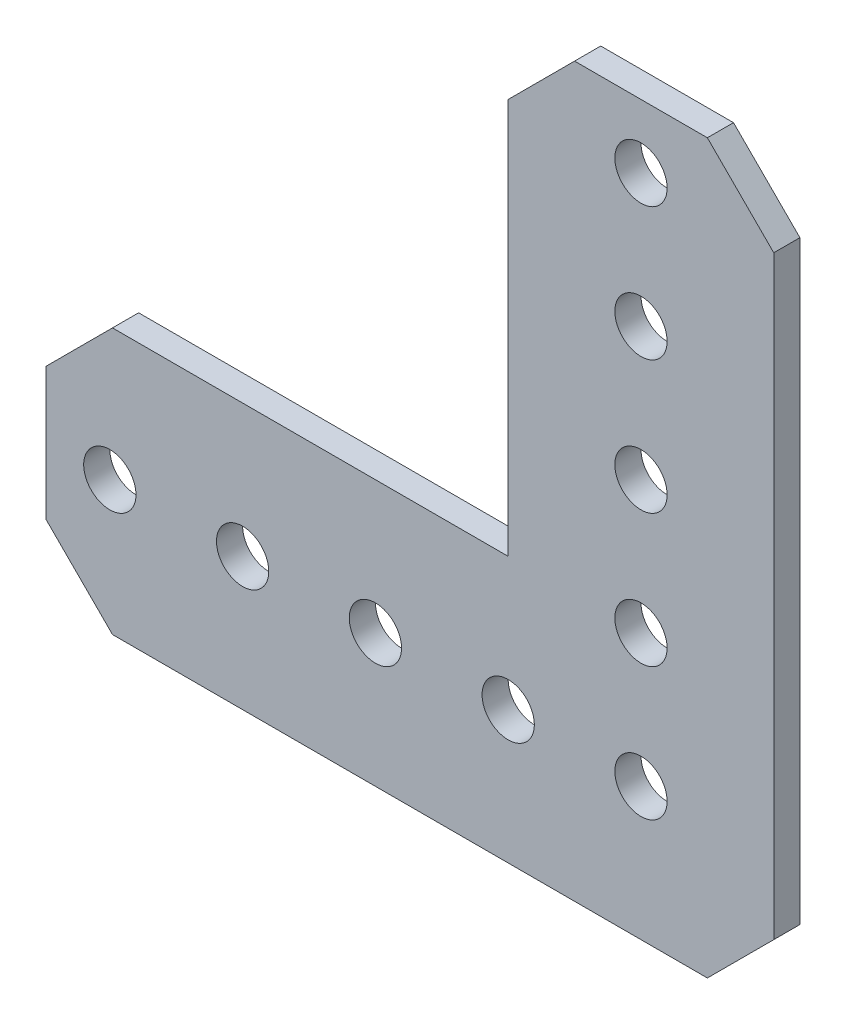
ISO-10303-21;
HEADER;
FILE_DESCRIPTION(('STEP AP214'),'2;1');
FILE_NAME('part.step','',(''),(''),'','','');
FILE_SCHEMA(('AUTOMOTIVE_DESIGN { 1 0 10303 214 1 1 1 1 }'));
ENDSEC;
DATA;
#1=APPLICATION_CONTEXT('core data for automotive mechanical design processes');
#2=APPLICATION_PROTOCOL_DEFINITION('international standard','automotive_design',2000,#1);
#3=PRODUCT_CONTEXT('',#1,'mechanical');
#4=PRODUCT('Part','Part','',(#3));
#5=PRODUCT_RELATED_PRODUCT_CATEGORY('part','',(#4));
#6=PRODUCT_DEFINITION_FORMATION('','',#4);
#7=PRODUCT_DEFINITION_CONTEXT('part definition',#1,'design');
#8=PRODUCT_DEFINITION('design','',#6,#7);
#9=PRODUCT_DEFINITION_SHAPE('','',#8);
#10=(LENGTH_UNIT() NAMED_UNIT(*) SI_UNIT(.MILLI.,.METRE.));
#11=(NAMED_UNIT(*) PLANE_ANGLE_UNIT() SI_UNIT($,.RADIAN.));
#12=(NAMED_UNIT(*) SI_UNIT($,.STERADIAN.) SOLID_ANGLE_UNIT());
#13=UNCERTAINTY_MEASURE_WITH_UNIT(LENGTH_MEASURE(1.E-05),#10,'distance_accuracy_value','');
#14=(GEOMETRIC_REPRESENTATION_CONTEXT(3) GLOBAL_UNCERTAINTY_ASSIGNED_CONTEXT((#13)) GLOBAL_UNIT_ASSIGNED_CONTEXT((#10,
#11,#12)) REPRESENTATION_CONTEXT('',''));
#15=CARTESIAN_POINT('',(0.,0.,0.));
#16=DIRECTION('',(0.,0.,1.));
#17=DIRECTION('',(1.,0.,0.));
#18=AXIS2_PLACEMENT_3D('',#15,#16,#17);
#19=CARTESIAN_POINT('',(12.7,-6.35,1.25));
#20=DIRECTION('',(0.707106781186548,-0.707106781186548,0.));
#21=DIRECTION('',(0.707106781186548,0.707106781186548,0.));
#22=AXIS2_PLACEMENT_3D('',#19,#20,#21);
#23=PLANE('',#22);
#24=DIRECTION('',(-0.707106781186547,-0.707106781186547,0.));
#25=VECTOR('',#24,1.);
#26=CARTESIAN_POINT('',(12.7,-6.35,-1.25));
#27=LINE('',#26,#25);
#28=CARTESIAN_POINT('',(12.7,-6.35,-1.25));
#29=VERTEX_POINT('',#28);
#30=CARTESIAN_POINT('',(6.35,-12.7,-1.25));
#31=VERTEX_POINT('',#30);
#32=EDGE_CURVE('E166',#29,#31,#27,.T.);
#33=ORIENTED_EDGE('',*,*,#32,.F.);
#34=DIRECTION('',(0.,0.,-1.));
#35=VECTOR('',#34,1.);
#36=CARTESIAN_POINT('',(12.7,-6.35,1.25));
#37=LINE('',#36,#35);
#38=CARTESIAN_POINT('',(12.7,-6.35,1.25));
#39=VERTEX_POINT('',#38);
#40=EDGE_CURVE('E11',#39,#29,#37,.T.);
#41=ORIENTED_EDGE('',*,*,#40,.F.);
#42=DIRECTION('',(-0.707106781186547,-0.707106781186547,0.));
#43=VECTOR('',#42,1.);
#44=CARTESIAN_POINT('',(12.7,-6.35,1.25));
#45=LINE('',#44,#43);
#46=CARTESIAN_POINT('',(6.35,-12.7,1.25));
#47=VERTEX_POINT('',#46);
#48=EDGE_CURVE('E207',#39,#47,#45,.T.);
#49=ORIENTED_EDGE('',*,*,#48,.T.);
#50=DIRECTION('',(0.,0.,-1.));
#51=VECTOR('',#50,1.);
#52=CARTESIAN_POINT('',(6.35,-12.7,1.25));
#53=LINE('',#52,#51);
#54=EDGE_CURVE('E48',#47,#31,#53,.T.);
#55=ORIENTED_EDGE('',*,*,#54,.T.);
#56=EDGE_LOOP('',(#33,#41,#49,#55));
#57=FACE_BOUND('',#56,.T.);
#58=ADVANCED_FACE('F45',(#57),#23,.T.);
#59=CARTESIAN_POINT('',(12.6999999999998,50.546,1.25));
#60=DIRECTION('',(1.,0.,0.));
#61=DIRECTION('',(0.,1.,0.));
#62=AXIS2_PLACEMENT_3D('',#59,#60,#61);
#63=PLANE('',#62);
#64=DIRECTION('',(0.,-1.,0.));
#65=VECTOR('',#64,1.);
#66=CARTESIAN_POINT('',(12.6999999999998,50.546,-1.25));
#67=LINE('',#66,#65);
#68=CARTESIAN_POINT('',(12.6999999999998,50.546,-1.25));
#69=VERTEX_POINT('',#68);
#70=EDGE_CURVE('E204',#69,#29,#67,.T.);
#71=ORIENTED_EDGE('',*,*,#70,.F.);
#72=DIRECTION('',(0.,0.,-1.));
#73=VECTOR('',#72,1.);
#74=CARTESIAN_POINT('',(12.6999999999998,50.546,1.25));
#75=LINE('',#74,#73);
#76=CARTESIAN_POINT('',(12.6999999999998,50.546,1.25));
#77=VERTEX_POINT('',#76);
#78=EDGE_CURVE('E55',#77,#69,#75,.T.);
#79=ORIENTED_EDGE('',*,*,#78,.F.);
#80=DIRECTION('',(0.,-1.,0.));
#81=VECTOR('',#80,1.);
#82=CARTESIAN_POINT('',(12.6999999999998,50.546,1.25));
#83=LINE('',#82,#81);
#84=EDGE_CURVE('E152',#77,#39,#83,.T.);
#85=ORIENTED_EDGE('',*,*,#84,.T.);
#86=ORIENTED_EDGE('',*,*,#40,.T.);
#87=EDGE_LOOP('',(#71,#79,#85,#86));
#88=FACE_BOUND('',#87,.T.);
#89=ADVANCED_FACE('F234',(#88),#63,.T.);
#90=CARTESIAN_POINT('',(6.34999999999981,56.896,1.25));
#91=DIRECTION('',(0.707106781186546,0.707106781186549,0.));
#92=DIRECTION('',(-0.707106781186549,0.707106781186546,0.));
#93=AXIS2_PLACEMENT_3D('',#90,#91,#92);
#94=PLANE('',#93);
#95=DIRECTION('',(0.707106781186549,-0.707106781186546,0.));
#96=VECTOR('',#95,1.);
#97=CARTESIAN_POINT('',(6.34999999999981,56.896,-1.25));
#98=LINE('',#97,#96);
#99=CARTESIAN_POINT('',(6.34999999999981,56.896,-1.25));
#100=VERTEX_POINT('',#99);
#101=EDGE_CURVE('E138',#100,#69,#98,.T.);
#102=ORIENTED_EDGE('',*,*,#101,.F.);
#103=DIRECTION('',(0.,0.,-1.));
#104=VECTOR('',#103,1.);
#105=CARTESIAN_POINT('',(6.34999999999981,56.896,1.25));
#106=LINE('',#105,#104);
#107=CARTESIAN_POINT('',(6.34999999999981,56.896,1.25));
#108=VERTEX_POINT('',#107);
#109=EDGE_CURVE('E133',#108,#100,#106,.T.);
#110=ORIENTED_EDGE('',*,*,#109,.F.);
#111=DIRECTION('',(0.707106781186549,-0.707106781186546,0.));
#112=VECTOR('',#111,1.);
#113=CARTESIAN_POINT('',(6.34999999999981,56.896,1.25));
#114=LINE('',#113,#112);
#115=EDGE_CURVE('E136',#108,#77,#114,.T.);
#116=ORIENTED_EDGE('',*,*,#115,.T.);
#117=ORIENTED_EDGE('',*,*,#78,.T.);
#118=EDGE_LOOP('',(#102,#110,#116,#117));
#119=FACE_BOUND('',#118,.T.);
#120=ADVANCED_FACE('F135',(#119),#94,.T.);
#121=CARTESIAN_POINT('',(-6.35000000000021,56.896,1.25));
#122=DIRECTION('',(0.,1.,0.));
#123=DIRECTION('',(0.,0.,1.));
#124=AXIS2_PLACEMENT_3D('',#121,#122,#123);
#125=PLANE('',#124);
#126=DIRECTION('',(1.,0.,0.));
#127=VECTOR('',#126,1.);
#128=CARTESIAN_POINT('',(-6.35000000000021,56.896,-1.25));
#129=LINE('',#128,#127);
#130=CARTESIAN_POINT('',(-6.35000000000021,56.896,-1.25));
#131=VERTEX_POINT('',#130);
#132=EDGE_CURVE('E199',#131,#100,#129,.T.);
#133=ORIENTED_EDGE('',*,*,#132,.F.);
#134=DIRECTION('',(0.,0.,-1.));
#135=VECTOR('',#134,1.);
#136=CARTESIAN_POINT('',(-6.35000000000021,56.896,1.25));
#137=LINE('',#136,#135);
#138=CARTESIAN_POINT('',(-6.35000000000021,56.896,1.25));
#139=VERTEX_POINT('',#138);
#140=EDGE_CURVE('E144',#139,#131,#137,.T.);
#141=ORIENTED_EDGE('',*,*,#140,.F.);
#142=DIRECTION('',(1.,0.,0.));
#143=VECTOR('',#142,1.);
#144=CARTESIAN_POINT('',(-6.35000000000021,56.896,1.25));
#145=LINE('',#144,#143);
#146=EDGE_CURVE('E150',#139,#108,#145,.T.);
#147=ORIENTED_EDGE('',*,*,#146,.T.);
#148=ORIENTED_EDGE('',*,*,#109,.T.);
#149=EDGE_LOOP('',(#133,#141,#147,#148));
#150=FACE_BOUND('',#149,.T.);
#151=ADVANCED_FACE('F155',(#150),#125,.T.);
#152=CARTESIAN_POINT('',(-12.7000000000002,50.546,1.25));
#153=DIRECTION('',(-0.707106781186548,0.707106781186547,0.));
#154=DIRECTION('',(-0.707106781186547,-0.707106781186548,0.));
#155=AXIS2_PLACEMENT_3D('',#152,#153,#154);
#156=PLANE('',#155);
#157=DIRECTION('',(0.707106781186547,0.707106781186548,0.));
#158=VECTOR('',#157,1.);
#159=CARTESIAN_POINT('',(-12.7000000000002,50.546,-1.25));
#160=LINE('',#159,#158);
#161=CARTESIAN_POINT('',(-12.7000000000002,50.546,-1.25));
#162=VERTEX_POINT('',#161);
#163=EDGE_CURVE('E195',#162,#131,#160,.T.);
#164=ORIENTED_EDGE('',*,*,#163,.F.);
#165=DIRECTION('',(0.,0.,-1.));
#166=VECTOR('',#165,1.);
#167=CARTESIAN_POINT('',(-12.7000000000002,50.546,1.25));
#168=LINE('',#167,#166);
#169=CARTESIAN_POINT('',(-12.7000000000002,50.546,1.25));
#170=VERTEX_POINT('',#169);
#171=EDGE_CURVE('E213',#170,#162,#168,.T.);
#172=ORIENTED_EDGE('',*,*,#171,.F.);
#173=DIRECTION('',(0.707106781186547,0.707106781186548,0.));
#174=VECTOR('',#173,1.);
#175=CARTESIAN_POINT('',(-12.7000000000002,50.546,1.25));
#176=LINE('',#175,#174);
#177=EDGE_CURVE('E157',#170,#139,#176,.T.);
#178=ORIENTED_EDGE('',*,*,#177,.T.);
#179=ORIENTED_EDGE('',*,*,#140,.T.);
#180=EDGE_LOOP('',(#164,#172,#178,#179));
#181=FACE_BOUND('',#180,.T.);
#182=ADVANCED_FACE('F247',(#181),#156,.T.);
#183=CARTESIAN_POINT('',(-12.7,12.7,1.25));
#184=DIRECTION('',(-1.,0.,0.));
#185=DIRECTION('',(0.,-1.,0.));
#186=AXIS2_PLACEMENT_3D('',#183,#184,#185);
#187=PLANE('',#186);
#188=DIRECTION('',(0.,1.,0.));
#189=VECTOR('',#188,1.);
#190=CARTESIAN_POINT('',(-12.7,12.7,-1.25));
#191=LINE('',#190,#189);
#192=CARTESIAN_POINT('',(-12.7,12.7,-1.25));
#193=VERTEX_POINT('',#192);
#194=EDGE_CURVE('E191',#193,#162,#191,.T.);
#195=ORIENTED_EDGE('',*,*,#194,.F.);
#196=DIRECTION('',(0.,0.,-1.));
#197=VECTOR('',#196,1.);
#198=CARTESIAN_POINT('',(-12.7,12.7,1.25));
#199=LINE('',#198,#197);
#200=CARTESIAN_POINT('',(-12.7,12.7,1.25));
#201=VERTEX_POINT('',#200);
#202=EDGE_CURVE('E216',#201,#193,#199,.T.);
#203=ORIENTED_EDGE('',*,*,#202,.F.);
#204=DIRECTION('',(0.,1.,0.));
#205=VECTOR('',#204,1.);
#206=CARTESIAN_POINT('',(-12.7,12.7,1.25));
#207=LINE('',#206,#205);
#208=EDGE_CURVE('E160',#201,#170,#207,.T.);
#209=ORIENTED_EDGE('',*,*,#208,.T.);
#210=ORIENTED_EDGE('',*,*,#171,.T.);
#211=EDGE_LOOP('',(#195,#203,#209,#210));
#212=FACE_BOUND('',#211,.T.);
#213=ADVANCED_FACE('F250',(#212),#187,.T.);
#214=CARTESIAN_POINT('',(-50.546,12.7,1.25));
#215=DIRECTION('',(0.,1.,0.));
#216=DIRECTION('',(0.,0.,1.));
#217=AXIS2_PLACEMENT_3D('',#214,#215,#216);
#218=PLANE('',#217);
#219=DIRECTION('',(1.,0.,0.));
#220=VECTOR('',#219,1.);
#221=CARTESIAN_POINT('',(-50.546,12.7,-1.25));
#222=LINE('',#221,#220);
#223=CARTESIAN_POINT('',(-50.546,12.7,-1.25));
#224=VERTEX_POINT('',#223);
#225=EDGE_CURVE('E187',#224,#193,#222,.T.);
#226=ORIENTED_EDGE('',*,*,#225,.F.);
#227=DIRECTION('',(0.,0.,-1.));
#228=VECTOR('',#227,1.);
#229=CARTESIAN_POINT('',(-50.546,12.7,1.25));
#230=LINE('',#229,#228);
#231=CARTESIAN_POINT('',(-50.546,12.7,1.25));
#232=VERTEX_POINT('',#231);
#233=EDGE_CURVE('E219',#232,#224,#230,.T.);
#234=ORIENTED_EDGE('',*,*,#233,.F.);
#235=DIRECTION('',(1.,0.,0.));
#236=VECTOR('',#235,1.);
#237=CARTESIAN_POINT('',(-50.546,12.7,1.25));
#238=LINE('',#237,#236);
#239=EDGE_CURVE('E410',#232,#201,#238,.T.);
#240=ORIENTED_EDGE('',*,*,#239,.T.);
#241=ORIENTED_EDGE('',*,*,#202,.T.);
#242=EDGE_LOOP('',(#226,#234,#240,#241));
#243=FACE_BOUND('',#242,.T.);
#244=ADVANCED_FACE('F254',(#243),#218,.T.);
#245=CARTESIAN_POINT('',(-56.896,6.35,1.25));
#246=DIRECTION('',(-0.707106781186547,0.707106781186548,0.));
#247=DIRECTION('',(-0.707106781186548,-0.707106781186547,0.));
#248=AXIS2_PLACEMENT_3D('',#245,#246,#247);
#249=PLANE('',#248);
#250=DIRECTION('',(0.707106781186548,0.707106781186547,0.));
#251=VECTOR('',#250,1.);
#252=CARTESIAN_POINT('',(-56.896,6.35,-1.25));
#253=LINE('',#252,#251);
#254=CARTESIAN_POINT('',(-56.896,6.35,-1.25));
#255=VERTEX_POINT('',#254);
#256=EDGE_CURVE('E183',#255,#224,#253,.T.);
#257=ORIENTED_EDGE('',*,*,#256,.F.);
#258=DIRECTION('',(0.,0.,-1.));
#259=VECTOR('',#258,1.);
#260=CARTESIAN_POINT('',(-56.896,6.35,1.25));
#261=LINE('',#260,#259);
#262=CARTESIAN_POINT('',(-56.896,6.35,1.25));
#263=VERTEX_POINT('',#262);
#264=EDGE_CURVE('E222',#263,#255,#261,.T.);
#265=ORIENTED_EDGE('',*,*,#264,.F.);
#266=DIRECTION('',(0.707106781186548,0.707106781186547,0.));
#267=VECTOR('',#266,1.);
#268=CARTESIAN_POINT('',(-56.896,6.35,1.25));
#269=LINE('',#268,#267);
#270=EDGE_CURVE('E406',#263,#232,#269,.T.);
#271=ORIENTED_EDGE('',*,*,#270,.T.);
#272=ORIENTED_EDGE('',*,*,#233,.T.);
#273=EDGE_LOOP('',(#257,#265,#271,#272));
#274=FACE_BOUND('',#273,.T.);
#275=ADVANCED_FACE('F258',(#274),#249,.T.);
#276=CARTESIAN_POINT('',(-56.896,-6.35,1.25));
#277=DIRECTION('',(-1.,0.,0.));
#278=DIRECTION('',(0.,0.,1.));
#279=AXIS2_PLACEMENT_3D('',#276,#277,#278);
#280=PLANE('',#279);
#281=DIRECTION('',(0.,1.,0.));
#282=VECTOR('',#281,1.);
#283=CARTESIAN_POINT('',(-56.896,-6.35,-1.25));
#284=LINE('',#283,#282);
#285=CARTESIAN_POINT('',(-56.896,-6.35,-1.25));
#286=VERTEX_POINT('',#285);
#287=EDGE_CURVE('E179',#286,#255,#284,.T.);
#288=ORIENTED_EDGE('',*,*,#287,.F.);
#289=DIRECTION('',(0.,0.,-1.));
#290=VECTOR('',#289,1.);
#291=CARTESIAN_POINT('',(-56.896,-6.35,1.25));
#292=LINE('',#291,#290);
#293=CARTESIAN_POINT('',(-56.896,-6.35,1.25));
#294=VERTEX_POINT('',#293);
#295=EDGE_CURVE('E225',#294,#286,#292,.T.);
#296=ORIENTED_EDGE('',*,*,#295,.F.);
#297=DIRECTION('',(0.,1.,0.));
#298=VECTOR('',#297,1.);
#299=CARTESIAN_POINT('',(-56.896,-6.35,1.25));
#300=LINE('',#299,#298);
#301=EDGE_CURVE('E402',#294,#263,#300,.T.);
#302=ORIENTED_EDGE('',*,*,#301,.T.);
#303=ORIENTED_EDGE('',*,*,#264,.T.);
#304=EDGE_LOOP('',(#288,#296,#302,#303));
#305=FACE_BOUND('',#304,.T.);
#306=ADVANCED_FACE('F262',(#305),#280,.T.);
#307=CARTESIAN_POINT('',(-50.546,-12.7,1.25));
#308=DIRECTION('',(-0.707106781186547,-0.707106781186548,0.));
#309=DIRECTION('',(0.707106781186548,-0.707106781186547,0.));
#310=AXIS2_PLACEMENT_3D('',#307,#308,#309);
#311=PLANE('',#310);
#312=DIRECTION('',(-0.707106781186548,0.707106781186547,0.));
#313=VECTOR('',#312,1.);
#314=CARTESIAN_POINT('',(-50.546,-12.7,-1.25));
#315=LINE('',#314,#313);
#316=CARTESIAN_POINT('',(-50.546,-12.7,-1.25));
#317=VERTEX_POINT('',#316);
#318=EDGE_CURVE('E175',#317,#286,#315,.T.);
#319=ORIENTED_EDGE('',*,*,#318,.F.);
#320=DIRECTION('',(0.,0.,-1.));
#321=VECTOR('',#320,1.);
#322=CARTESIAN_POINT('',(-50.546,-12.7,1.25));
#323=LINE('',#322,#321);
#324=CARTESIAN_POINT('',(-50.546,-12.7,1.25));
#325=VERTEX_POINT('',#324);
#326=EDGE_CURVE('E227',#325,#317,#323,.T.);
#327=ORIENTED_EDGE('',*,*,#326,.F.);
#328=DIRECTION('',(-0.707106781186548,0.707106781186547,0.));
#329=VECTOR('',#328,1.);
#330=CARTESIAN_POINT('',(-50.546,-12.7,1.25));
#331=LINE('',#330,#329);
#332=EDGE_CURVE('E398',#325,#294,#331,.T.);
#333=ORIENTED_EDGE('',*,*,#332,.T.);
#334=ORIENTED_EDGE('',*,*,#295,.T.);
#335=EDGE_LOOP('',(#319,#327,#333,#334));
#336=FACE_BOUND('',#335,.T.);
#337=ADVANCED_FACE('F266',(#336),#311,.T.);
#338=CARTESIAN_POINT('',(6.35,-12.7,1.25));
#339=DIRECTION('',(0.,-1.,0.));
#340=DIRECTION('',(0.,0.,-1.));
#341=AXIS2_PLACEMENT_3D('',#338,#339,#340);
#342=PLANE('',#341);
#343=DIRECTION('',(-1.,0.,0.));
#344=VECTOR('',#343,1.);
#345=CARTESIAN_POINT('',(6.35,-12.7,-1.25));
#346=LINE('',#345,#344);
#347=EDGE_CURVE('E170',#31,#317,#346,.T.);
#348=ORIENTED_EDGE('',*,*,#347,.F.);
#349=ORIENTED_EDGE('',*,*,#54,.F.);
#350=DIRECTION('',(-1.,0.,0.));
#351=VECTOR('',#350,1.);
#352=CARTESIAN_POINT('',(6.35,-12.7,1.25));
#353=LINE('',#352,#351);
#354=EDGE_CURVE('E395',#47,#325,#353,.T.);
#355=ORIENTED_EDGE('',*,*,#354,.T.);
#356=ORIENTED_EDGE('',*,*,#326,.T.);
#357=EDGE_LOOP('',(#348,#349,#355,#356));
#358=FACE_BOUND('',#357,.T.);
#359=ADVANCED_FACE('F231',(#358),#342,.T.);
#360=CARTESIAN_POINT('',(0.,0.,1.25));
#361=DIRECTION('',(0.,0.,-1.));
#362=DIRECTION('',(-1.,0.,0.));
#363=AXIS2_PLACEMENT_3D('',#360,#361,#362);
#364=PLANE('',#363);
#365=CARTESIAN_POINT('',(0.,38.1,1.25));
#366=DIRECTION('',(0.,0.,-1.));
#367=DIRECTION('',(1.,0.,0.));
#368=AXIS2_PLACEMENT_3D('',#365,#366,#367);
#369=CIRCLE('',#368,2.5);
#370=CARTESIAN_POINT('',(2.50000000000004,38.1,1.25));
#371=VERTEX_POINT('',#370);
#372=EDGE_CURVE('E321',#371,#371,#369,.T.);
#373=ORIENTED_EDGE('',*,*,#372,.T.);
#374=EDGE_LOOP('',(#373));
#375=FACE_BOUND('',#374,.T.);
#376=CARTESIAN_POINT('',(0.,50.8,1.25));
#377=DIRECTION('',(0.,0.,-1.));
#378=DIRECTION('',(1.,0.,0.));
#379=AXIS2_PLACEMENT_3D('',#376,#377,#378);
#380=CIRCLE('',#379,2.5);
#381=CARTESIAN_POINT('',(2.5,50.8,1.25));
#382=VERTEX_POINT('',#381);
#383=EDGE_CURVE('E331',#382,#382,#380,.T.);
#384=ORIENTED_EDGE('',*,*,#383,.T.);
#385=EDGE_LOOP('',(#384));
#386=FACE_BOUND('',#385,.T.);
#387=CARTESIAN_POINT('',(-38.1,0.,1.25));
#388=DIRECTION('',(0.,0.,-1.));
#389=DIRECTION('',(1.,0.,0.));
#390=AXIS2_PLACEMENT_3D('',#387,#388,#389);
#391=CIRCLE('',#390,2.5);
#392=CARTESIAN_POINT('',(-35.6,0.,1.25));
#393=VERTEX_POINT('',#392);
#394=EDGE_CURVE('E339',#393,#393,#391,.T.);
#395=ORIENTED_EDGE('',*,*,#394,.T.);
#396=EDGE_LOOP('',(#395));
#397=FACE_BOUND('',#396,.T.);
#398=CARTESIAN_POINT('',(-50.8,0.,1.25));
#399=DIRECTION('',(0.,0.,-1.));
#400=DIRECTION('',(1.,0.,0.));
#401=AXIS2_PLACEMENT_3D('',#398,#399,#400);
#402=CIRCLE('',#401,2.5);
#403=CARTESIAN_POINT('',(-48.3,0.,1.25));
#404=VERTEX_POINT('',#403);
#405=EDGE_CURVE('E347',#404,#404,#402,.T.);
#406=ORIENTED_EDGE('',*,*,#405,.T.);
#407=EDGE_LOOP('',(#406));
#408=FACE_BOUND('',#407,.T.);
#409=CARTESIAN_POINT('',(0.,0.,1.25));
#410=DIRECTION('',(0.,0.,-1.));
#411=DIRECTION('',(1.,0.,0.));
#412=AXIS2_PLACEMENT_3D('',#409,#410,#411);
#413=CIRCLE('',#412,2.5);
#414=CARTESIAN_POINT('',(2.5,0.,1.25));
#415=VERTEX_POINT('',#414);
#416=EDGE_CURVE('E355',#415,#415,#413,.T.);
#417=ORIENTED_EDGE('',*,*,#416,.T.);
#418=EDGE_LOOP('',(#417));
#419=FACE_BOUND('',#418,.T.);
#420=CARTESIAN_POINT('',(-25.4,0.,1.25));
#421=DIRECTION('',(0.,0.,-1.));
#422=DIRECTION('',(1.,0.,0.));
#423=AXIS2_PLACEMENT_3D('',#420,#421,#422);
#424=CIRCLE('',#423,2.5);
#425=CARTESIAN_POINT('',(-22.9,0.,1.25));
#426=VERTEX_POINT('',#425);
#427=EDGE_CURVE('E363',#426,#426,#424,.T.);
#428=ORIENTED_EDGE('',*,*,#427,.T.);
#429=EDGE_LOOP('',(#428));
#430=FACE_BOUND('',#429,.T.);
#431=CARTESIAN_POINT('',(-12.7,0.,1.25));
#432=DIRECTION('',(0.,0.,-1.));
#433=DIRECTION('',(1.,0.,0.));
#434=AXIS2_PLACEMENT_3D('',#431,#432,#433);
#435=CIRCLE('',#434,2.5);
#436=CARTESIAN_POINT('',(-10.2,0.,1.25));
#437=VERTEX_POINT('',#436);
#438=EDGE_CURVE('E371',#437,#437,#435,.T.);
#439=ORIENTED_EDGE('',*,*,#438,.T.);
#440=EDGE_LOOP('',(#439));
#441=FACE_BOUND('',#440,.T.);
#442=CARTESIAN_POINT('',(0.,25.4,1.25));
#443=DIRECTION('',(0.,0.,-1.));
#444=DIRECTION('',(1.,0.,0.));
#445=AXIS2_PLACEMENT_3D('',#442,#443,#444);
#446=CIRCLE('',#445,2.5);
#447=CARTESIAN_POINT('',(2.50000000000008,25.4,1.25));
#448=VERTEX_POINT('',#447);
#449=EDGE_CURVE('E379',#448,#448,#446,.T.);
#450=ORIENTED_EDGE('',*,*,#449,.T.);
#451=EDGE_LOOP('',(#450));
#452=FACE_BOUND('',#451,.T.);
#453=CARTESIAN_POINT('',(1.19131612205636E-13,12.7,1.25));
#454=DIRECTION('',(0.,0.,-1.));
#455=DIRECTION('',(1.,0.,0.));
#456=AXIS2_PLACEMENT_3D('',#453,#454,#455);
#457=CIRCLE('',#456,2.5);
#458=CARTESIAN_POINT('',(2.50000000000012,12.7,1.25));
#459=VERTEX_POINT('',#458);
#460=EDGE_CURVE('E171',#459,#459,#457,.T.);
#461=ORIENTED_EDGE('',*,*,#460,.T.);
#462=EDGE_LOOP('',(#461));
#463=FACE_BOUND('',#462,.T.);
#464=ORIENTED_EDGE('',*,*,#48,.F.);
#465=ORIENTED_EDGE('',*,*,#84,.F.);
#466=ORIENTED_EDGE('',*,*,#115,.F.);
#467=ORIENTED_EDGE('',*,*,#146,.F.);
#468=ORIENTED_EDGE('',*,*,#177,.F.);
#469=ORIENTED_EDGE('',*,*,#208,.F.);
#470=ORIENTED_EDGE('',*,*,#239,.F.);
#471=ORIENTED_EDGE('',*,*,#270,.F.);
#472=ORIENTED_EDGE('',*,*,#301,.F.);
#473=ORIENTED_EDGE('',*,*,#332,.F.);
#474=ORIENTED_EDGE('',*,*,#354,.F.);
#475=EDGE_LOOP('',(#464,#465,#466,#467,#468,#469,#470,#471,#472,#473,#474));
#476=FACE_BOUND('',#475,.T.);
#477=ADVANCED_FACE('F148',(#375,#386,#397,#408,#419,#430,#441,#452,#463,#476),#364,.F.);
#478=CARTESIAN_POINT('',(0.,0.,-1.25));
#479=DIRECTION('',(0.,0.,-1.));
#480=DIRECTION('',(-1.,0.,0.));
#481=AXIS2_PLACEMENT_3D('',#478,#479,#480);
#482=PLANE('',#481);
#483=CARTESIAN_POINT('',(0.,38.1,-1.25));
#484=DIRECTION('',(0.,0.,-1.));
#485=DIRECTION('',(1.,0.,0.));
#486=AXIS2_PLACEMENT_3D('',#483,#484,#485);
#487=CIRCLE('',#486,2.5);
#488=CARTESIAN_POINT('',(2.50000000000004,38.1,-1.25));
#489=VERTEX_POINT('',#488);
#490=EDGE_CURVE('E324',#489,#489,#487,.T.);
#491=ORIENTED_EDGE('',*,*,#490,.F.);
#492=EDGE_LOOP('',(#491));
#493=FACE_BOUND('',#492,.T.);
#494=CARTESIAN_POINT('',(0.,50.8,-1.25));
#495=DIRECTION('',(0.,0.,-1.));
#496=DIRECTION('',(1.,0.,0.));
#497=AXIS2_PLACEMENT_3D('',#494,#495,#496);
#498=CIRCLE('',#497,2.5);
#499=CARTESIAN_POINT('',(2.5,50.8,-1.25));
#500=VERTEX_POINT('',#499);
#501=EDGE_CURVE('E328',#500,#500,#498,.T.);
#502=ORIENTED_EDGE('',*,*,#501,.F.);
#503=EDGE_LOOP('',(#502));
#504=FACE_BOUND('',#503,.T.);
#505=CARTESIAN_POINT('',(-38.1,0.,-1.25));
#506=DIRECTION('',(0.,0.,-1.));
#507=DIRECTION('',(1.,0.,0.));
#508=AXIS2_PLACEMENT_3D('',#505,#506,#507);
#509=CIRCLE('',#508,2.5);
#510=CARTESIAN_POINT('',(-35.6,0.,-1.25));
#511=VERTEX_POINT('',#510);
#512=EDGE_CURVE('E335',#511,#511,#509,.T.);
#513=ORIENTED_EDGE('',*,*,#512,.F.);
#514=EDGE_LOOP('',(#513));
#515=FACE_BOUND('',#514,.T.);
#516=CARTESIAN_POINT('',(-50.8,0.,-1.25));
#517=DIRECTION('',(0.,0.,-1.));
#518=DIRECTION('',(1.,0.,0.));
#519=AXIS2_PLACEMENT_3D('',#516,#517,#518);
#520=CIRCLE('',#519,2.5);
#521=CARTESIAN_POINT('',(-48.3,0.,-1.25));
#522=VERTEX_POINT('',#521);
#523=EDGE_CURVE('E343',#522,#522,#520,.T.);
#524=ORIENTED_EDGE('',*,*,#523,.F.);
#525=EDGE_LOOP('',(#524));
#526=FACE_BOUND('',#525,.T.);
#527=CARTESIAN_POINT('',(0.,0.,-1.25));
#528=DIRECTION('',(0.,0.,-1.));
#529=DIRECTION('',(1.,0.,0.));
#530=AXIS2_PLACEMENT_3D('',#527,#528,#529);
#531=CIRCLE('',#530,2.5);
#532=CARTESIAN_POINT('',(2.5,0.,-1.25));
#533=VERTEX_POINT('',#532);
#534=EDGE_CURVE('E351',#533,#533,#531,.T.);
#535=ORIENTED_EDGE('',*,*,#534,.F.);
#536=EDGE_LOOP('',(#535));
#537=FACE_BOUND('',#536,.T.);
#538=CARTESIAN_POINT('',(-25.4,0.,-1.25));
#539=DIRECTION('',(0.,0.,-1.));
#540=DIRECTION('',(1.,0.,0.));
#541=AXIS2_PLACEMENT_3D('',#538,#539,#540);
#542=CIRCLE('',#541,2.5);
#543=CARTESIAN_POINT('',(-22.9,0.,-1.25));
#544=VERTEX_POINT('',#543);
#545=EDGE_CURVE('E359',#544,#544,#542,.T.);
#546=ORIENTED_EDGE('',*,*,#545,.F.);
#547=EDGE_LOOP('',(#546));
#548=FACE_BOUND('',#547,.T.);
#549=CARTESIAN_POINT('',(-12.7,0.,-1.25));
#550=DIRECTION('',(0.,0.,-1.));
#551=DIRECTION('',(1.,0.,0.));
#552=AXIS2_PLACEMENT_3D('',#549,#550,#551);
#553=CIRCLE('',#552,2.5);
#554=CARTESIAN_POINT('',(-10.2,0.,-1.25));
#555=VERTEX_POINT('',#554);
#556=EDGE_CURVE('E367',#555,#555,#553,.T.);
#557=ORIENTED_EDGE('',*,*,#556,.F.);
#558=EDGE_LOOP('',(#557));
#559=FACE_BOUND('',#558,.T.);
#560=CARTESIAN_POINT('',(0.,25.4,-1.25));
#561=DIRECTION('',(0.,0.,-1.));
#562=DIRECTION('',(1.,0.,0.));
#563=AXIS2_PLACEMENT_3D('',#560,#561,#562);
#564=CIRCLE('',#563,2.5);
#565=CARTESIAN_POINT('',(2.50000000000008,25.4,-1.25));
#566=VERTEX_POINT('',#565);
#567=EDGE_CURVE('E375',#566,#566,#564,.T.);
#568=ORIENTED_EDGE('',*,*,#567,.F.);
#569=EDGE_LOOP('',(#568));
#570=FACE_BOUND('',#569,.T.);
#571=CARTESIAN_POINT('',(1.19131612205636E-13,12.7,-1.25));
#572=DIRECTION('',(0.,0.,-1.));
#573=DIRECTION('',(1.,0.,0.));
#574=AXIS2_PLACEMENT_3D('',#571,#572,#573);
#575=CIRCLE('',#574,2.5);
#576=CARTESIAN_POINT('',(2.50000000000012,12.7,-1.25));
#577=VERTEX_POINT('',#576);
#578=EDGE_CURVE('E383',#577,#577,#575,.T.);
#579=ORIENTED_EDGE('',*,*,#578,.F.);
#580=EDGE_LOOP('',(#579));
#581=FACE_BOUND('',#580,.T.);
#582=ORIENTED_EDGE('',*,*,#32,.T.);
#583=ORIENTED_EDGE('',*,*,#347,.T.);
#584=ORIENTED_EDGE('',*,*,#318,.T.);
#585=ORIENTED_EDGE('',*,*,#287,.T.);
#586=ORIENTED_EDGE('',*,*,#256,.T.);
#587=ORIENTED_EDGE('',*,*,#225,.T.);
#588=ORIENTED_EDGE('',*,*,#194,.T.);
#589=ORIENTED_EDGE('',*,*,#163,.T.);
#590=ORIENTED_EDGE('',*,*,#132,.T.);
#591=ORIENTED_EDGE('',*,*,#101,.T.);
#592=ORIENTED_EDGE('',*,*,#70,.T.);
#593=EDGE_LOOP('',(#582,#583,#584,#585,#586,#587,#588,#589,#590,#591,#592));
#594=FACE_BOUND('',#593,.T.);
#595=ADVANCED_FACE('F233',(#493,#504,#515,#526,#537,#548,#559,#570,#581,#594),#482,.T.);
#596=CARTESIAN_POINT('',(1.19131612205636E-13,12.7,1.25));
#597=DIRECTION('',(0.,0.,-1.));
#598=DIRECTION('',(-1.,0.,0.));
#599=AXIS2_PLACEMENT_3D('',#596,#597,#598);
#600=CYLINDRICAL_SURFACE('',#599,2.5);
#601=ORIENTED_EDGE('',*,*,#460,.F.);
#602=EDGE_LOOP('',(#601));
#603=FACE_BOUND('',#602,.T.);
#604=ORIENTED_EDGE('',*,*,#578,.T.);
#605=EDGE_LOOP('',(#604));
#606=FACE_BOUND('',#605,.T.);
#607=ADVANCED_FACE('F278',(#603,#606),#600,.F.);
#608=CARTESIAN_POINT('',(0.,25.4,1.25));
#609=DIRECTION('',(0.,0.,-1.));
#610=DIRECTION('',(-1.,0.,0.));
#611=AXIS2_PLACEMENT_3D('',#608,#609,#610);
#612=CYLINDRICAL_SURFACE('',#611,2.5);
#613=ORIENTED_EDGE('',*,*,#449,.F.);
#614=EDGE_LOOP('',(#613));
#615=FACE_BOUND('',#614,.T.);
#616=ORIENTED_EDGE('',*,*,#567,.T.);
#617=EDGE_LOOP('',(#616));
#618=FACE_BOUND('',#617,.T.);
#619=ADVANCED_FACE('F285',(#615,#618),#612,.F.);
#620=CARTESIAN_POINT('',(-12.7,0.,1.25));
#621=DIRECTION('',(0.,0.,-1.));
#622=DIRECTION('',(-1.,0.,0.));
#623=AXIS2_PLACEMENT_3D('',#620,#621,#622);
#624=CYLINDRICAL_SURFACE('',#623,2.5);
#625=ORIENTED_EDGE('',*,*,#438,.F.);
#626=EDGE_LOOP('',(#625));
#627=FACE_BOUND('',#626,.T.);
#628=ORIENTED_EDGE('',*,*,#556,.T.);
#629=EDGE_LOOP('',(#628));
#630=FACE_BOUND('',#629,.T.);
#631=ADVANCED_FACE('F289',(#627,#630),#624,.F.);
#632=CARTESIAN_POINT('',(-25.4,0.,1.25));
#633=DIRECTION('',(0.,0.,-1.));
#634=DIRECTION('',(-1.,0.,0.));
#635=AXIS2_PLACEMENT_3D('',#632,#633,#634);
#636=CYLINDRICAL_SURFACE('',#635,2.5);
#637=ORIENTED_EDGE('',*,*,#427,.F.);
#638=EDGE_LOOP('',(#637));
#639=FACE_BOUND('',#638,.T.);
#640=ORIENTED_EDGE('',*,*,#545,.T.);
#641=EDGE_LOOP('',(#640));
#642=FACE_BOUND('',#641,.T.);
#643=ADVANCED_FACE('F293',(#639,#642),#636,.F.);
#644=CARTESIAN_POINT('',(0.,0.,1.25));
#645=DIRECTION('',(0.,0.,-1.));
#646=DIRECTION('',(-1.,0.,0.));
#647=AXIS2_PLACEMENT_3D('',#644,#645,#646);
#648=CYLINDRICAL_SURFACE('',#647,2.5);
#649=ORIENTED_EDGE('',*,*,#416,.F.);
#650=EDGE_LOOP('',(#649));
#651=FACE_BOUND('',#650,.T.);
#652=ORIENTED_EDGE('',*,*,#534,.T.);
#653=EDGE_LOOP('',(#652));
#654=FACE_BOUND('',#653,.T.);
#655=ADVANCED_FACE('F297',(#651,#654),#648,.F.);
#656=CARTESIAN_POINT('',(-50.8,0.,1.25));
#657=DIRECTION('',(0.,0.,-1.));
#658=DIRECTION('',(-1.,0.,0.));
#659=AXIS2_PLACEMENT_3D('',#656,#657,#658);
#660=CYLINDRICAL_SURFACE('',#659,2.5);
#661=ORIENTED_EDGE('',*,*,#405,.F.);
#662=EDGE_LOOP('',(#661));
#663=FACE_BOUND('',#662,.T.);
#664=ORIENTED_EDGE('',*,*,#523,.T.);
#665=EDGE_LOOP('',(#664));
#666=FACE_BOUND('',#665,.T.);
#667=ADVANCED_FACE('F301',(#663,#666),#660,.F.);
#668=CARTESIAN_POINT('',(-38.1,0.,1.25));
#669=DIRECTION('',(0.,0.,-1.));
#670=DIRECTION('',(-1.,0.,0.));
#671=AXIS2_PLACEMENT_3D('',#668,#669,#670);
#672=CYLINDRICAL_SURFACE('',#671,2.5);
#673=ORIENTED_EDGE('',*,*,#394,.F.);
#674=EDGE_LOOP('',(#673));
#675=FACE_BOUND('',#674,.T.);
#676=ORIENTED_EDGE('',*,*,#512,.T.);
#677=EDGE_LOOP('',(#676));
#678=FACE_BOUND('',#677,.T.);
#679=ADVANCED_FACE('F305',(#675,#678),#672,.F.);
#680=CARTESIAN_POINT('',(0.,50.8,1.25));
#681=DIRECTION('',(0.,0.,-1.));
#682=DIRECTION('',(-1.,0.,0.));
#683=AXIS2_PLACEMENT_3D('',#680,#681,#682);
#684=CYLINDRICAL_SURFACE('',#683,2.5);
#685=ORIENTED_EDGE('',*,*,#383,.F.);
#686=EDGE_LOOP('',(#685));
#687=FACE_BOUND('',#686,.T.);
#688=ORIENTED_EDGE('',*,*,#501,.T.);
#689=EDGE_LOOP('',(#688));
#690=FACE_BOUND('',#689,.T.);
#691=ADVANCED_FACE('F309',(#687,#690),#684,.F.);
#692=CARTESIAN_POINT('',(0.,38.1,1.25));
#693=DIRECTION('',(0.,0.,-1.));
#694=DIRECTION('',(-1.,0.,0.));
#695=AXIS2_PLACEMENT_3D('',#692,#693,#694);
#696=CYLINDRICAL_SURFACE('',#695,2.5);
#697=ORIENTED_EDGE('',*,*,#372,.F.);
#698=EDGE_LOOP('',(#697));
#699=FACE_BOUND('',#698,.T.);
#700=ORIENTED_EDGE('',*,*,#490,.T.);
#701=EDGE_LOOP('',(#700));
#702=FACE_BOUND('',#701,.T.);
#703=ADVANCED_FACE('F313',(#699,#702),#696,.F.);
#704=CLOSED_SHELL('',(#58,#89,#120,#151,#182,#213,#244,#275,#306,#337,#359,#477,#595,#607,#619,
#631,#643,#655,#667,#679,#691,#703));
#705=MANIFOLD_SOLID_BREP('B2',#704);
#706=ADVANCED_BREP_SHAPE_REPRESENTATION('',(#18,#705),#14);
#707=SHAPE_DEFINITION_REPRESENTATION(#9,#706);
ENDSEC;
END-ISO-10303-21;
